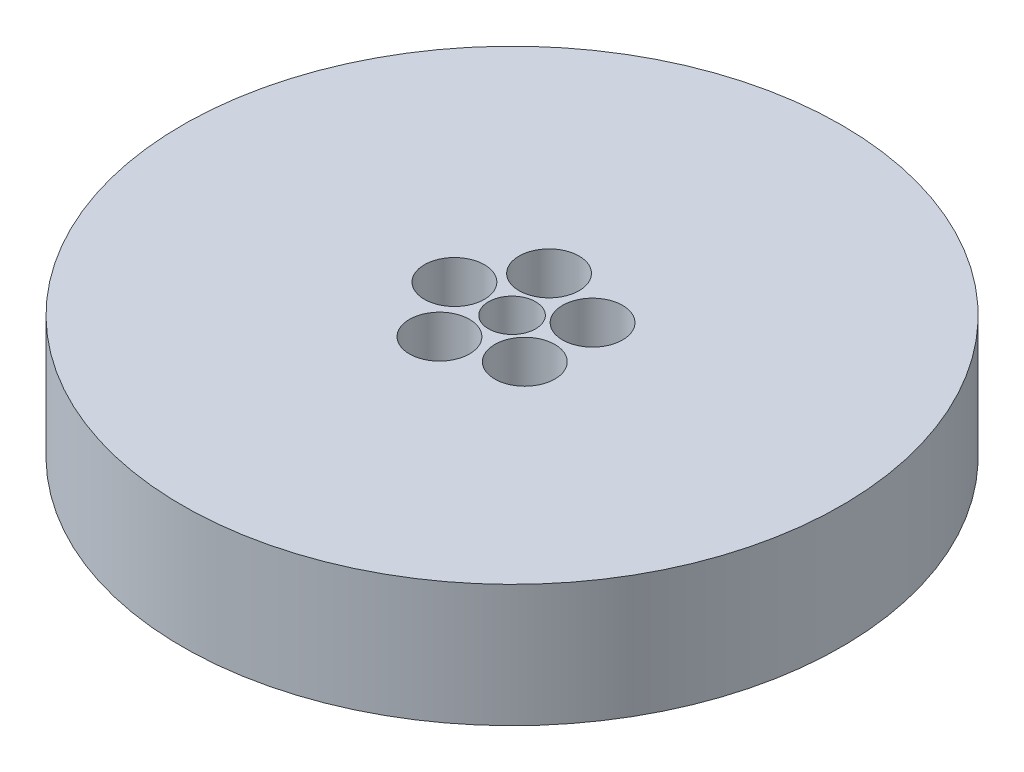
ISO-10303-21;
HEADER;
FILE_DESCRIPTION(('STEP AP214'),'2;1');
FILE_NAME('part.step','',(''),(''),'','','');
FILE_SCHEMA(('AUTOMOTIVE_DESIGN { 1 0 10303 214 1 1 1 1 }'));
ENDSEC;
DATA;
#1=APPLICATION_CONTEXT('core data for automotive mechanical design processes');
#2=APPLICATION_PROTOCOL_DEFINITION('international standard','automotive_design',2000,#1);
#3=PRODUCT_CONTEXT('',#1,'mechanical');
#4=PRODUCT('Part','Part','',(#3));
#5=PRODUCT_RELATED_PRODUCT_CATEGORY('part','',(#4));
#6=PRODUCT_DEFINITION_FORMATION('','',#4);
#7=PRODUCT_DEFINITION_CONTEXT('part definition',#1,'design');
#8=PRODUCT_DEFINITION('design','',#6,#7);
#9=PRODUCT_DEFINITION_SHAPE('','',#8);
#10=(LENGTH_UNIT() NAMED_UNIT(*) SI_UNIT(.MILLI.,.METRE.));
#11=(NAMED_UNIT(*) PLANE_ANGLE_UNIT() SI_UNIT($,.RADIAN.));
#12=(NAMED_UNIT(*) SI_UNIT($,.STERADIAN.) SOLID_ANGLE_UNIT());
#13=UNCERTAINTY_MEASURE_WITH_UNIT(LENGTH_MEASURE(1.E-05),#10,'distance_accuracy_value','');
#14=(GEOMETRIC_REPRESENTATION_CONTEXT(3) GLOBAL_UNCERTAINTY_ASSIGNED_CONTEXT((#13)) GLOBAL_UNIT_ASSIGNED_CONTEXT((#10,
#11,#12)) REPRESENTATION_CONTEXT('',''));
#15=CARTESIAN_POINT('',(0.,0.,0.));
#16=DIRECTION('',(0.,0.,1.));
#17=DIRECTION('',(1.,0.,0.));
#18=AXIS2_PLACEMENT_3D('',#15,#16,#17);
#19=CARTESIAN_POINT('',(0.,26.,0.));
#20=DIRECTION('',(0.,-1.,0.));
#21=DIRECTION('',(0.,0.,-1.));
#22=AXIS2_PLACEMENT_3D('',#19,#20,#21);
#23=CYLINDRICAL_SURFACE('',#22,70.);
#24=CARTESIAN_POINT('',(0.,26.,0.));
#25=DIRECTION('',(0.,1.,0.));
#26=DIRECTION('',(0.,0.,1.));
#27=AXIS2_PLACEMENT_3D('',#24,#25,#26);
#28=CIRCLE('',#27,70.);
#29=CARTESIAN_POINT('',(0.,26.,-70.));
#30=VERTEX_POINT('',#29);
#31=EDGE_CURVE('E10',#30,#30,#28,.T.);
#32=CARTESIAN_POINT('',(0.,0.,0.));
#33=DIRECTION('',(0.,1.,0.));
#34=DIRECTION('',(0.,0.,1.));
#35=AXIS2_PLACEMENT_3D('',#32,#33,#34);
#36=CIRCLE('',#35,70.);
#37=CARTESIAN_POINT('',(0.,0.,-70.));
#38=VERTEX_POINT('',#37);
#39=EDGE_CURVE('E37',#38,#38,#36,.T.);
#40=CARTESIAN_POINT('',(0.,26.,-70.));
#41=CARTESIAN_POINT('',(0.,25.7291666666667,-70.));
#42=CARTESIAN_POINT('',(0.,25.4583333333333,-70.));
#43=CARTESIAN_POINT('',(0.,24.9166666666667,-70.));
#44=CARTESIAN_POINT('',(0.,24.6458333333333,-70.));
#45=CARTESIAN_POINT('',(0.,24.1041666666667,-70.));
#46=CARTESIAN_POINT('',(0.,23.8333333333333,-70.));
#47=CARTESIAN_POINT('',(0.,23.2916666666667,-70.));
#48=CARTESIAN_POINT('',(0.,23.0208333333333,-70.));
#49=CARTESIAN_POINT('',(0.,22.4791666666667,-70.));
#50=CARTESIAN_POINT('',(0.,22.2083333333333,-70.));
#51=CARTESIAN_POINT('',(0.,21.6666666666667,-70.));
#52=CARTESIAN_POINT('',(0.,21.3958333333333,-70.));
#53=CARTESIAN_POINT('',(0.,20.8541666666667,-70.));
#54=CARTESIAN_POINT('',(0.,20.5833333333333,-70.));
#55=CARTESIAN_POINT('',(0.,20.0416666666667,-70.));
#56=CARTESIAN_POINT('',(0.,19.7708333333333,-70.));
#57=CARTESIAN_POINT('',(0.,19.2291666666667,-70.));
#58=CARTESIAN_POINT('',(0.,18.9583333333333,-70.));
#59=CARTESIAN_POINT('',(0.,18.4166666666667,-70.));
#60=CARTESIAN_POINT('',(0.,18.1458333333333,-70.));
#61=CARTESIAN_POINT('',(0.,17.6041666666667,-70.));
#62=CARTESIAN_POINT('',(0.,17.3333333333333,-70.));
#63=CARTESIAN_POINT('',(0.,16.7916666666667,-70.));
#64=CARTESIAN_POINT('',(0.,16.5208333333333,-70.));
#65=CARTESIAN_POINT('',(0.,15.9791666666667,-70.));
#66=CARTESIAN_POINT('',(0.,15.7083333333333,-70.));
#67=CARTESIAN_POINT('',(0.,15.1666666666667,-70.));
#68=CARTESIAN_POINT('',(0.,14.8958333333333,-70.));
#69=CARTESIAN_POINT('',(0.,14.3541666666667,-70.));
#70=CARTESIAN_POINT('',(0.,14.0833333333333,-70.));
#71=CARTESIAN_POINT('',(0.,13.5416666666667,-70.));
#72=CARTESIAN_POINT('',(0.,13.2708333333333,-70.));
#73=CARTESIAN_POINT('',(0.,12.7291666666667,-70.));
#74=CARTESIAN_POINT('',(0.,12.4583333333333,-70.));
#75=CARTESIAN_POINT('',(0.,11.9166666666667,-70.));
#76=CARTESIAN_POINT('',(0.,11.6458333333333,-70.));
#77=CARTESIAN_POINT('',(0.,11.1041666666667,-70.));
#78=CARTESIAN_POINT('',(0.,10.8333333333333,-70.));
#79=CARTESIAN_POINT('',(0.,10.2916666666667,-70.));
#80=CARTESIAN_POINT('',(0.,10.0208333333333,-70.));
#81=CARTESIAN_POINT('',(0.,9.47916666666667,-70.));
#82=CARTESIAN_POINT('',(0.,9.20833333333333,-70.));
#83=CARTESIAN_POINT('',(0.,8.66666666666667,-70.));
#84=CARTESIAN_POINT('',(0.,8.39583333333333,-70.));
#85=CARTESIAN_POINT('',(0.,7.85416666666667,-70.));
#86=CARTESIAN_POINT('',(0.,7.58333333333333,-70.));
#87=CARTESIAN_POINT('',(0.,7.04166666666667,-70.));
#88=CARTESIAN_POINT('',(0.,6.77083333333333,-70.));
#89=CARTESIAN_POINT('',(0.,6.22916666666667,-70.));
#90=CARTESIAN_POINT('',(0.,5.95833333333333,-70.));
#91=CARTESIAN_POINT('',(0.,5.41666666666667,-70.));
#92=CARTESIAN_POINT('',(0.,5.14583333333333,-70.));
#93=CARTESIAN_POINT('',(0.,4.60416666666667,-70.));
#94=CARTESIAN_POINT('',(0.,4.33333333333333,-70.));
#95=CARTESIAN_POINT('',(0.,3.79166666666667,-70.));
#96=CARTESIAN_POINT('',(0.,3.52083333333333,-70.));
#97=CARTESIAN_POINT('',(0.,2.97916666666667,-70.));
#98=CARTESIAN_POINT('',(0.,2.70833333333333,-70.));
#99=CARTESIAN_POINT('',(0.,2.16666666666667,-70.));
#100=CARTESIAN_POINT('',(0.,1.89583333333333,-70.));
#101=CARTESIAN_POINT('',(0.,1.35416666666667,-70.));
#102=CARTESIAN_POINT('',(0.,1.08333333333333,-70.));
#103=CARTESIAN_POINT('',(0.,0.541666666666667,-70.));
#104=CARTESIAN_POINT('',(0.,0.270833333333334,-70.));
#105=CARTESIAN_POINT('',(0.,0.,-70.));
#106=B_SPLINE_CURVE_WITH_KNOTS('',3,(#40,#41,#42,#43,#44,#45,#46,#47,#48,#49,#50,#51,#52,#53,
#54,#55,#56,#57,#58,#59,#60,#61,#62,#63,#64,#65,#66,#67,#68,#69,#70,#71,#72,#73,#74,#75,#76,#77,
#78,#79,#80,#81,#82,#83,#84,#85,#86,#87,#88,#89,#90,#91,#92,#93,#94,#95,#96,#97,#98,#99,#100,
#101,#102,#103,#104,#105),.UNSPECIFIED.,.F.,.F.,(4,2,2,2,2,2,2,2,2,2,2,2,2,2,2,2,2,2,2,2,2,2,2,
2,2,2,2,2,2,2,2,2,4),(0.,0.812500000000001,1.625,2.4375,3.25,4.0625,4.875,5.6875,6.5,7.3125,
8.125,8.9375,9.75,10.5625,11.375,12.1875,13.,13.8125,14.625,15.4375,16.25,17.0625,17.875,
18.6875,19.5,20.3125,21.125,21.9375,22.75,23.5625,24.375,25.1875,26.),.UNSPECIFIED.);
#107=EDGE_CURVE('BSEAM40',#30,#38,#106,.T.);
#108=ORIENTED_EDGE('',*,*,#31,.F.);
#109=ORIENTED_EDGE('',*,*,#39,.T.);
#110=ORIENTED_EDGE('',*,*,#107,.T.);
#111=ORIENTED_EDGE('',*,*,#107,.F.);
#112=EDGE_LOOP('',(#108,#110,#109,#111));
#113=FACE_BOUND('',#112,.T.);
#114=ADVANCED_FACE('F40',(#113),#23,.T.);
#115=CARTESIAN_POINT('',(0.,26.,0.));
#116=DIRECTION('',(0.,1.,0.));
#117=DIRECTION('',(0.,0.,1.));
#118=AXIS2_PLACEMENT_3D('',#115,#116,#117);
#119=PLANE('',#118);
#120=CARTESIAN_POINT('',(-3.78207299259383,26.,-11.6400237857007));
#121=DIRECTION('',(0.,1.,0.));
#122=DIRECTION('',(-0.95105651629515,0.,0.309016994374958));
#123=AXIS2_PLACEMENT_3D('',#120,#121,#122);
#124=CIRCLE('',#123,6.37805570849755);
#125=CARTESIAN_POINT('',(-9.84796443545391,26.,-9.66909618070478));
#126=VERTEX_POINT('',#125);
#127=EDGE_CURVE('E70',#126,#126,#124,.T.);
#128=ORIENTED_EDGE('',*,*,#127,.F.);
#129=EDGE_LOOP('',(#128));
#130=FACE_BOUND('',#129,.T.);
#131=CARTESIAN_POINT('',(9.90159564254327,26.,-7.19393032942039));
#132=DIRECTION('',(0.,1.,0.));
#133=DIRECTION('',(-0.58778525229248,0.,-0.809016994374942));
#134=AXIS2_PLACEMENT_3D('',#131,#132,#133);
#135=CIRCLE('',#134,6.37805570849755);
#136=CARTESIAN_POINT('',(6.15266855878855,26.,-12.353885788665));
#137=VERTEX_POINT('',#136);
#138=EDGE_CURVE('E71',#137,#137,#135,.T.);
#139=ORIENTED_EDGE('',*,*,#138,.F.);
#140=EDGE_LOOP('',(#139));
#141=FACE_BOUND('',#140,.T.);
#142=CARTESIAN_POINT('',(9.90159564254338,26.,7.19393032942025));
#143=DIRECTION('',(0.,1.,0.));
#144=DIRECTION('',(0.587785252292469,0.,-0.809016994374951));
#145=AXIS2_PLACEMENT_3D('',#142,#143,#144);
#146=CIRCLE('',#145,6.37805570849755);
#147=CARTESIAN_POINT('',(13.650522726298,26.,2.03397487017556));
#148=VERTEX_POINT('',#147);
#149=EDGE_CURVE('E78',#148,#148,#146,.T.);
#150=ORIENTED_EDGE('',*,*,#149,.F.);
#151=EDGE_LOOP('',(#150));
#152=FACE_BOUND('',#151,.T.);
#153=CARTESIAN_POINT('',(-3.78207299259367,26.,11.6400237857008));
#154=DIRECTION('',(0.,1.,0.));
#155=DIRECTION('',(0.951056516295155,0.,0.309016994374945));
#156=AXIS2_PLACEMENT_3D('',#153,#154,#155);
#157=CIRCLE('',#156,6.37805570849755);
#158=CARTESIAN_POINT('',(2.28381845026643,26.,13.6109513906967));
#159=VERTEX_POINT('',#158);
#160=EDGE_CURVE('E61',#159,#159,#157,.T.);
#161=ORIENTED_EDGE('',*,*,#160,.F.);
#162=EDGE_LOOP('',(#161));
#163=FACE_BOUND('',#162,.T.);
#164=CARTESIAN_POINT('',(-12.2390452998993,26.,0.));
#165=DIRECTION('',(0.,1.,0.));
#166=DIRECTION('',(0.,0.,1.));
#167=AXIS2_PLACEMENT_3D('',#164,#165,#166);
#168=CIRCLE('',#167,6.37805570849755);
#169=CARTESIAN_POINT('',(-12.2390452998993,26.,6.37805570849755));
#170=VERTEX_POINT('',#169);
#171=EDGE_CURVE('E54',#170,#170,#168,.T.);
#172=ORIENTED_EDGE('',*,*,#171,.F.);
#173=EDGE_LOOP('',(#172));
#174=FACE_BOUND('',#173,.T.);
#175=CARTESIAN_POINT('',(0.,26.,0.));
#176=DIRECTION('',(0.,1.,0.));
#177=DIRECTION('',(0.,0.,1.));
#178=AXIS2_PLACEMENT_3D('',#175,#176,#177);
#179=CIRCLE('',#178,5.);
#180=CARTESIAN_POINT('',(0.,26.,-5.));
#181=VERTEX_POINT('',#180);
#182=EDGE_CURVE('E50',#181,#181,#179,.T.);
#183=ORIENTED_EDGE('',*,*,#182,.F.);
#184=EDGE_LOOP('',(#183));
#185=FACE_BOUND('',#184,.T.);
#186=ORIENTED_EDGE('',*,*,#31,.T.);
#187=EDGE_LOOP('',(#186));
#188=FACE_BOUND('',#187,.T.);
#189=ADVANCED_FACE('F94',(#130,#141,#152,#163,#174,#185,#188),#119,.T.);
#190=CARTESIAN_POINT('',(0.,0.,0.));
#191=DIRECTION('',(0.,1.,0.));
#192=DIRECTION('',(0.,0.,1.));
#193=AXIS2_PLACEMENT_3D('',#190,#191,#192);
#194=PLANE('',#193);
#195=CARTESIAN_POINT('',(0.,0.,0.));
#196=DIRECTION('',(0.,1.,0.));
#197=DIRECTION('',(0.,0.,1.));
#198=AXIS2_PLACEMENT_3D('',#195,#196,#197);
#199=CIRCLE('',#198,5.);
#200=CARTESIAN_POINT('',(0.,0.,-5.));
#201=VERTEX_POINT('',#200);
#202=EDGE_CURVE('E47',#201,#201,#199,.T.);
#203=ORIENTED_EDGE('',*,*,#202,.T.);
#204=EDGE_LOOP('',(#203));
#205=FACE_BOUND('',#204,.T.);
#206=ORIENTED_EDGE('',*,*,#39,.F.);
#207=EDGE_LOOP('',(#206));
#208=FACE_BOUND('',#207,.T.);
#209=ADVANCED_FACE('F100',(#205,#208),#194,.F.);
#210=CARTESIAN_POINT('',(0.,26.,0.));
#211=DIRECTION('',(0.,-1.,0.));
#212=DIRECTION('',(0.,0.,-1.));
#213=AXIS2_PLACEMENT_3D('',#210,#211,#212);
#214=CYLINDRICAL_SURFACE('',#213,5.);
#215=CARTESIAN_POINT('',(0.,26.,-5.));
#216=CARTESIAN_POINT('',(0.,25.7291666666667,-5.));
#217=CARTESIAN_POINT('',(0.,25.4583333333333,-5.));
#218=CARTESIAN_POINT('',(0.,24.9166666666667,-5.));
#219=CARTESIAN_POINT('',(0.,24.6458333333333,-5.));
#220=CARTESIAN_POINT('',(0.,24.1041666666667,-5.));
#221=CARTESIAN_POINT('',(0.,23.8333333333333,-5.));
#222=CARTESIAN_POINT('',(0.,23.2916666666667,-5.));
#223=CARTESIAN_POINT('',(0.,23.0208333333333,-5.));
#224=CARTESIAN_POINT('',(0.,22.4791666666667,-5.));
#225=CARTESIAN_POINT('',(0.,22.2083333333333,-5.));
#226=CARTESIAN_POINT('',(0.,21.6666666666667,-5.));
#227=CARTESIAN_POINT('',(0.,21.3958333333333,-5.));
#228=CARTESIAN_POINT('',(0.,20.8541666666667,-5.));
#229=CARTESIAN_POINT('',(0.,20.5833333333333,-5.));
#230=CARTESIAN_POINT('',(0.,20.0416666666667,-5.));
#231=CARTESIAN_POINT('',(0.,19.7708333333333,-5.));
#232=CARTESIAN_POINT('',(0.,19.2291666666667,-5.));
#233=CARTESIAN_POINT('',(0.,18.9583333333333,-5.));
#234=CARTESIAN_POINT('',(0.,18.4166666666667,-5.));
#235=CARTESIAN_POINT('',(0.,18.1458333333333,-5.));
#236=CARTESIAN_POINT('',(0.,17.6041666666667,-5.));
#237=CARTESIAN_POINT('',(0.,17.3333333333333,-5.));
#238=CARTESIAN_POINT('',(0.,16.7916666666667,-5.));
#239=CARTESIAN_POINT('',(0.,16.5208333333333,-5.));
#240=CARTESIAN_POINT('',(0.,15.9791666666667,-5.));
#241=CARTESIAN_POINT('',(0.,15.7083333333333,-5.));
#242=CARTESIAN_POINT('',(0.,15.1666666666667,-5.));
#243=CARTESIAN_POINT('',(0.,14.8958333333333,-5.));
#244=CARTESIAN_POINT('',(0.,14.3541666666667,-5.));
#245=CARTESIAN_POINT('',(0.,14.0833333333333,-5.));
#246=CARTESIAN_POINT('',(0.,13.5416666666667,-5.));
#247=CARTESIAN_POINT('',(0.,13.2708333333333,-5.));
#248=CARTESIAN_POINT('',(0.,12.7291666666667,-5.));
#249=CARTESIAN_POINT('',(0.,12.4583333333333,-5.));
#250=CARTESIAN_POINT('',(0.,11.9166666666667,-5.));
#251=CARTESIAN_POINT('',(0.,11.6458333333333,-5.));
#252=CARTESIAN_POINT('',(0.,11.1041666666667,-5.));
#253=CARTESIAN_POINT('',(0.,10.8333333333333,-5.));
#254=CARTESIAN_POINT('',(0.,10.2916666666667,-5.));
#255=CARTESIAN_POINT('',(0.,10.0208333333333,-5.));
#256=CARTESIAN_POINT('',(0.,9.47916666666667,-5.));
#257=CARTESIAN_POINT('',(0.,9.20833333333333,-5.));
#258=CARTESIAN_POINT('',(0.,8.66666666666667,-5.));
#259=CARTESIAN_POINT('',(0.,8.39583333333333,-5.));
#260=CARTESIAN_POINT('',(0.,7.85416666666667,-5.));
#261=CARTESIAN_POINT('',(0.,7.58333333333333,-5.));
#262=CARTESIAN_POINT('',(0.,7.04166666666667,-5.));
#263=CARTESIAN_POINT('',(0.,6.77083333333333,-5.));
#264=CARTESIAN_POINT('',(0.,6.22916666666667,-5.));
#265=CARTESIAN_POINT('',(0.,5.95833333333333,-5.));
#266=CARTESIAN_POINT('',(0.,5.41666666666667,-5.));
#267=CARTESIAN_POINT('',(0.,5.14583333333333,-5.));
#268=CARTESIAN_POINT('',(0.,4.60416666666667,-5.));
#269=CARTESIAN_POINT('',(0.,4.33333333333333,-5.));
#270=CARTESIAN_POINT('',(0.,3.79166666666667,-5.));
#271=CARTESIAN_POINT('',(0.,3.52083333333333,-5.));
#272=CARTESIAN_POINT('',(0.,2.97916666666667,-5.));
#273=CARTESIAN_POINT('',(0.,2.70833333333333,-5.));
#274=CARTESIAN_POINT('',(0.,2.16666666666667,-5.));
#275=CARTESIAN_POINT('',(0.,1.89583333333333,-5.));
#276=CARTESIAN_POINT('',(0.,1.35416666666667,-5.));
#277=CARTESIAN_POINT('',(0.,1.08333333333333,-5.));
#278=CARTESIAN_POINT('',(0.,0.541666666666667,-5.));
#279=CARTESIAN_POINT('',(0.,0.270833333333334,-5.));
#280=CARTESIAN_POINT('',(0.,0.,-5.));
#281=B_SPLINE_CURVE_WITH_KNOTS('',3,(#215,#216,#217,#218,#219,#220,#221,#222,#223,#224,#225,
#226,#227,#228,#229,#230,#231,#232,#233,#234,#235,#236,#237,#238,#239,#240,#241,#242,#243,#244,
#245,#246,#247,#248,#249,#250,#251,#252,#253,#254,#255,#256,#257,#258,#259,#260,#261,#262,#263,
#264,#265,#266,#267,#268,#269,#270,#271,#272,#273,#274,#275,#276,#277,#278,#279,#280),
.UNSPECIFIED.,.F.,.F.,(4,2,2,2,2,2,2,2,2,2,2,2,2,2,2,2,2,2,2,2,2,2,2,2,2,2,2,2,2,2,2,2,4),(0.,
0.812499999999997,1.625,2.4375,3.25,4.0625,4.875,5.6875,6.5,7.3125,8.125,8.93749999999999,
9.74999999999999,10.5625,11.375,12.1875,13.,13.8125,14.625,15.4375,16.25,17.0625,17.875,18.6875,
19.5,20.3125,21.125,21.9375,22.75,23.5625,24.375,25.1875,26.),.UNSPECIFIED.);
#282=EDGE_CURVE('BSEAM106',#181,#201,#281,.T.);
#283=ORIENTED_EDGE('',*,*,#182,.T.);
#284=ORIENTED_EDGE('',*,*,#202,.F.);
#285=ORIENTED_EDGE('',*,*,#282,.T.);
#286=ORIENTED_EDGE('',*,*,#282,.F.);
#287=EDGE_LOOP('',(#283,#285,#284,#286));
#288=FACE_BOUND('',#287,.T.);
#289=ADVANCED_FACE('F106',(#288),#214,.F.);
#290=CARTESIAN_POINT('',(-12.2390452998993,9.87928400093663,0.));
#291=DIRECTION('',(0.,1.,0.));
#292=DIRECTION('',(0.,0.,1.));
#293=AXIS2_PLACEMENT_3D('',#290,#291,#292);
#294=CYLINDRICAL_SURFACE('',#293,6.37805570849755);
#295=CARTESIAN_POINT('',(-12.2390452998993,9.87928400093663,0.));
#296=DIRECTION('',(0.,1.,0.));
#297=DIRECTION('',(0.,0.,1.));
#298=AXIS2_PLACEMENT_3D('',#295,#296,#297);
#299=CIRCLE('',#298,6.37805570849755);
#300=CARTESIAN_POINT('',(-12.2390452998993,9.87928400093663,6.37805570849755));
#301=VERTEX_POINT('',#300);
#302=EDGE_CURVE('E55',#301,#301,#299,.T.);
#303=ORIENTED_EDGE('',*,*,#302,.F.);
#304=EDGE_LOOP('',(#303));
#305=FACE_BOUND('',#304,.T.);
#306=ORIENTED_EDGE('',*,*,#171,.T.);
#307=EDGE_LOOP('',(#306));
#308=FACE_BOUND('',#307,.T.);
#309=ADVANCED_FACE('F108',(#305,#308),#294,.F.);
#310=CARTESIAN_POINT('',(-12.2390452998993,9.87928400093663,0.));
#311=DIRECTION('',(0.,1.,0.));
#312=DIRECTION('',(0.,0.,1.));
#313=AXIS2_PLACEMENT_3D('',#310,#311,#312);
#314=PLANE('',#313);
#315=ORIENTED_EDGE('',*,*,#302,.T.);
#316=EDGE_LOOP('',(#315));
#317=FACE_BOUND('',#316,.T.);
#318=ADVANCED_FACE('F138',(#317),#314,.T.);
#319=CARTESIAN_POINT('',(-3.78207299259367,9.87928400093663,11.6400237857008));
#320=DIRECTION('',(0.,1.,0.));
#321=DIRECTION('',(0.,0.,1.));
#322=AXIS2_PLACEMENT_3D('',#319,#320,#321);
#323=CYLINDRICAL_SURFACE('',#322,6.37805570849755);
#324=CARTESIAN_POINT('',(-3.78207299259367,9.87928400093663,11.6400237857008));
#325=DIRECTION('',(0.,1.,0.));
#326=DIRECTION('',(0.951056516295155,0.,0.309016994374945));
#327=AXIS2_PLACEMENT_3D('',#324,#325,#326);
#328=CIRCLE('',#327,6.37805570849755);
#329=CARTESIAN_POINT('',(2.28381845026643,9.87928400093663,13.6109513906967));
#330=VERTEX_POINT('',#329);
#331=EDGE_CURVE('E59',#330,#330,#328,.T.);
#332=ORIENTED_EDGE('',*,*,#331,.F.);
#333=EDGE_LOOP('',(#332));
#334=FACE_BOUND('',#333,.T.);
#335=ORIENTED_EDGE('',*,*,#160,.T.);
#336=EDGE_LOOP('',(#335));
#337=FACE_BOUND('',#336,.T.);
#338=ADVANCED_FACE('F150',(#334,#337),#323,.F.);
#339=CARTESIAN_POINT('',(-3.78207299259367,9.87928400093663,11.6400237857008));
#340=DIRECTION('',(0.,1.,0.));
#341=DIRECTION('',(0.951056516295155,0.,0.309016994374945));
#342=AXIS2_PLACEMENT_3D('',#339,#340,#341);
#343=PLANE('',#342);
#344=ORIENTED_EDGE('',*,*,#331,.T.);
#345=EDGE_LOOP('',(#344));
#346=FACE_BOUND('',#345,.T.);
#347=ADVANCED_FACE('F89',(#346),#343,.T.);
#348=CARTESIAN_POINT('',(9.90159564254338,9.87928400093663,7.19393032942025));
#349=DIRECTION('',(0.,1.,0.));
#350=DIRECTION('',(0.,0.,1.));
#351=AXIS2_PLACEMENT_3D('',#348,#349,#350);
#352=CYLINDRICAL_SURFACE('',#351,6.37805570849755);
#353=CARTESIAN_POINT('',(9.90159564254338,9.87928400093663,7.19393032942025));
#354=DIRECTION('',(0.,1.,0.));
#355=DIRECTION('',(0.587785252292469,0.,-0.809016994374951));
#356=AXIS2_PLACEMENT_3D('',#353,#354,#355);
#357=CIRCLE('',#356,6.37805570849755);
#358=CARTESIAN_POINT('',(13.650522726298,9.87928400093663,2.03397487017556));
#359=VERTEX_POINT('',#358);
#360=EDGE_CURVE('E63',#359,#359,#357,.T.);
#361=ORIENTED_EDGE('',*,*,#360,.F.);
#362=EDGE_LOOP('',(#361));
#363=FACE_BOUND('',#362,.T.);
#364=ORIENTED_EDGE('',*,*,#149,.T.);
#365=EDGE_LOOP('',(#364));
#366=FACE_BOUND('',#365,.T.);
#367=ADVANCED_FACE('F87',(#363,#366),#352,.F.);
#368=CARTESIAN_POINT('',(9.90159564254338,9.87928400093663,7.19393032942025));
#369=DIRECTION('',(0.,1.,0.));
#370=DIRECTION('',(0.587785252292469,0.,-0.809016994374951));
#371=AXIS2_PLACEMENT_3D('',#368,#369,#370);
#372=PLANE('',#371);
#373=ORIENTED_EDGE('',*,*,#360,.T.);
#374=EDGE_LOOP('',(#373));
#375=FACE_BOUND('',#374,.T.);
#376=ADVANCED_FACE('F84',(#375),#372,.T.);
#377=CARTESIAN_POINT('',(9.90159564254327,9.87928400093663,-7.19393032942039));
#378=DIRECTION('',(0.,1.,0.));
#379=DIRECTION('',(0.,0.,1.));
#380=AXIS2_PLACEMENT_3D('',#377,#378,#379);
#381=CYLINDRICAL_SURFACE('',#380,6.37805570849755);
#382=CARTESIAN_POINT('',(9.90159564254327,9.87928400093663,-7.19393032942039));
#383=DIRECTION('',(0.,1.,0.));
#384=DIRECTION('',(-0.58778525229248,0.,-0.809016994374942));
#385=AXIS2_PLACEMENT_3D('',#382,#383,#384);
#386=CIRCLE('',#385,6.37805570849755);
#387=CARTESIAN_POINT('',(6.15266855878855,9.87928400093663,-12.353885788665));
#388=VERTEX_POINT('',#387);
#389=EDGE_CURVE('E76',#388,#388,#386,.T.);
#390=ORIENTED_EDGE('',*,*,#389,.F.);
#391=EDGE_LOOP('',(#390));
#392=FACE_BOUND('',#391,.T.);
#393=ORIENTED_EDGE('',*,*,#138,.T.);
#394=EDGE_LOOP('',(#393));
#395=FACE_BOUND('',#394,.T.);
#396=ADVANCED_FACE('F185',(#392,#395),#381,.F.);
#397=CARTESIAN_POINT('',(9.90159564254327,9.87928400093663,-7.19393032942039));
#398=DIRECTION('',(0.,1.,0.));
#399=DIRECTION('',(-0.58778525229248,0.,-0.809016994374942));
#400=AXIS2_PLACEMENT_3D('',#397,#398,#399);
#401=PLANE('',#400);
#402=ORIENTED_EDGE('',*,*,#389,.T.);
#403=EDGE_LOOP('',(#402));
#404=FACE_BOUND('',#403,.T.);
#405=ADVANCED_FACE('F189',(#404),#401,.T.);
#406=CARTESIAN_POINT('',(-3.78207299259383,9.87928400093663,-11.6400237857007));
#407=DIRECTION('',(0.,1.,0.));
#408=DIRECTION('',(0.,0.,1.));
#409=AXIS2_PLACEMENT_3D('',#406,#407,#408);
#410=CYLINDRICAL_SURFACE('',#409,6.37805570849755);
#411=CARTESIAN_POINT('',(-3.78207299259383,9.87928400093663,-11.6400237857007));
#412=DIRECTION('',(0.,1.,0.));
#413=DIRECTION('',(-0.95105651629515,0.,0.309016994374958));
#414=AXIS2_PLACEMENT_3D('',#411,#412,#413);
#415=CIRCLE('',#414,6.37805570849755);
#416=CARTESIAN_POINT('',(-9.84796443545391,9.87928400093663,-9.66909618070478));
#417=VERTEX_POINT('',#416);
#418=EDGE_CURVE('E69',#417,#417,#415,.T.);
#419=ORIENTED_EDGE('',*,*,#418,.F.);
#420=EDGE_LOOP('',(#419));
#421=FACE_BOUND('',#420,.T.);
#422=ORIENTED_EDGE('',*,*,#127,.T.);
#423=EDGE_LOOP('',(#422));
#424=FACE_BOUND('',#423,.T.);
#425=ADVANCED_FACE('F200',(#421,#424),#410,.F.);
#426=CARTESIAN_POINT('',(-3.78207299259383,9.87928400093663,-11.6400237857007));
#427=DIRECTION('',(0.,1.,0.));
#428=DIRECTION('',(-0.95105651629515,0.,0.309016994374958));
#429=AXIS2_PLACEMENT_3D('',#426,#427,#428);
#430=PLANE('',#429);
#431=ORIENTED_EDGE('',*,*,#418,.T.);
#432=EDGE_LOOP('',(#431));
#433=FACE_BOUND('',#432,.T.);
#434=ADVANCED_FACE('F208',(#433),#430,.T.);
#435=CLOSED_SHELL('',(#114,#189,#209,#289,#309,#318,#338,#347,#367,#376,#396,#405,#425,#434));
#436=MANIFOLD_SOLID_BREP('B2',#435);
#437=ADVANCED_BREP_SHAPE_REPRESENTATION('',(#18,#436),#14);
#438=SHAPE_DEFINITION_REPRESENTATION(#9,#437);
ENDSEC;
END-ISO-10303-21;
